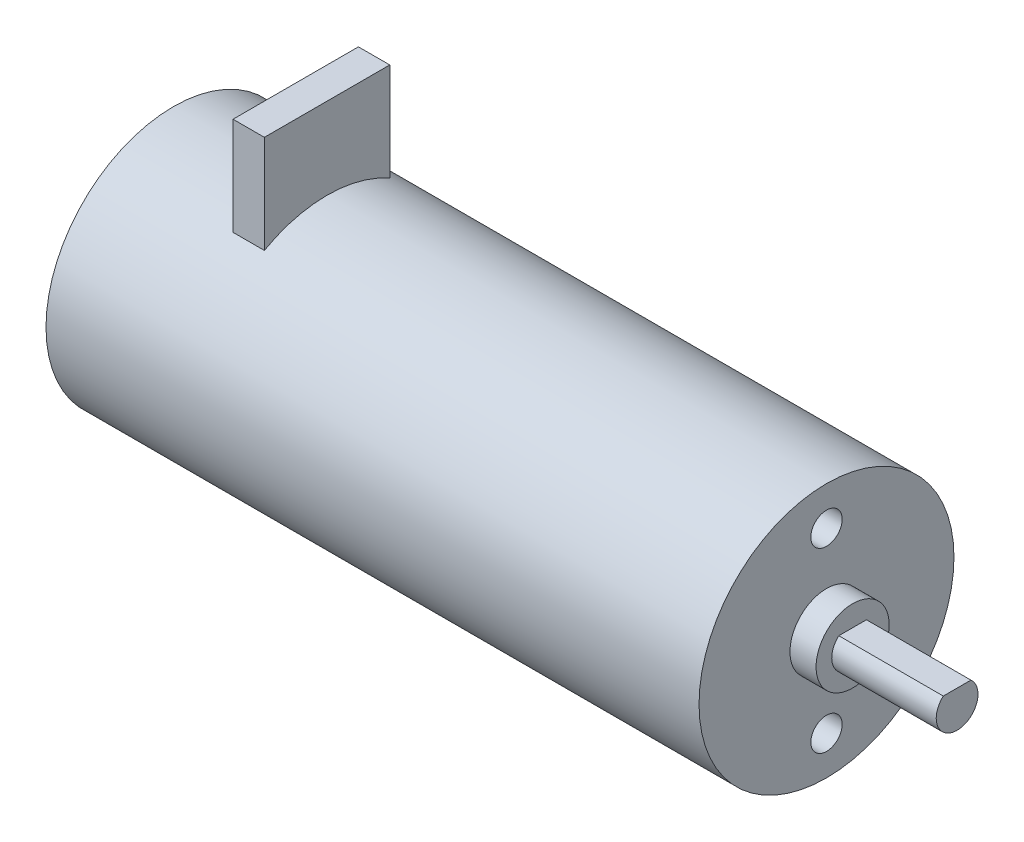
ISO-10303-21;
HEADER;
FILE_DESCRIPTION(('STEP AP214'),'2;1');
FILE_NAME('part.step','',(''),(''),'','','');
FILE_SCHEMA(('AUTOMOTIVE_DESIGN { 1 0 10303 214 1 1 1 1 }'));
ENDSEC;
DATA;
#1=APPLICATION_CONTEXT('core data for automotive mechanical design processes');
#2=APPLICATION_PROTOCOL_DEFINITION('international standard','automotive_design',2000,#1);
#3=PRODUCT_CONTEXT('',#1,'mechanical');
#4=PRODUCT('Part','Part','',(#3));
#5=PRODUCT_RELATED_PRODUCT_CATEGORY('part','',(#4));
#6=PRODUCT_DEFINITION_FORMATION('','',#4);
#7=PRODUCT_DEFINITION_CONTEXT('part definition',#1,'design');
#8=PRODUCT_DEFINITION('design','',#6,#7);
#9=PRODUCT_DEFINITION_SHAPE('','',#8);
#10=(LENGTH_UNIT() NAMED_UNIT(*) SI_UNIT(.MILLI.,.METRE.));
#11=(NAMED_UNIT(*) PLANE_ANGLE_UNIT() SI_UNIT($,.RADIAN.));
#12=(NAMED_UNIT(*) SI_UNIT($,.STERADIAN.) SOLID_ANGLE_UNIT());
#13=UNCERTAINTY_MEASURE_WITH_UNIT(LENGTH_MEASURE(1.E-05),#10,'distance_accuracy_value','');
#14=(GEOMETRIC_REPRESENTATION_CONTEXT(3) GLOBAL_UNCERTAINTY_ASSIGNED_CONTEXT((#13)) GLOBAL_UNIT_ASSIGNED_CONTEXT((#10,
#11,#12)) REPRESENTATION_CONTEXT('',''));
#15=CARTESIAN_POINT('',(0.,0.,0.));
#16=DIRECTION('',(0.,0.,1.));
#17=DIRECTION('',(1.,0.,0.));
#18=AXIS2_PLACEMENT_3D('',#15,#16,#17);
#19=CARTESIAN_POINT('',(62.5,0.,0.));
#20=DIRECTION('',(-1.,0.,0.));
#21=DIRECTION('',(0.,0.,1.));
#22=AXIS2_PLACEMENT_3D('',#19,#20,#21);
#23=CYLINDRICAL_SURFACE('',#22,12.2);
#24=CARTESIAN_POINT('',(0.,0.,0.));
#25=DIRECTION('',(1.,0.,0.));
#26=DIRECTION('',(0.,0.,-1.));
#27=AXIS2_PLACEMENT_3D('',#24,#25,#26);
#28=CIRCLE('',#27,12.2);
#29=CARTESIAN_POINT('',(0.,0.,-12.2));
#30=VERTEX_POINT('',#29);
#31=EDGE_CURVE('E161',#30,#30,#28,.T.);
#32=ORIENTED_EDGE('',*,*,#31,.T.);
#33=EDGE_LOOP('',(#32));
#34=FACE_BOUND('',#33,.T.);
#35=CARTESIAN_POINT('',(62.5,0.,0.));
#36=DIRECTION('',(1.,0.,0.));
#37=DIRECTION('',(0.,0.,-1.));
#38=AXIS2_PLACEMENT_3D('',#35,#36,#37);
#39=CIRCLE('',#38,12.2);
#40=CARTESIAN_POINT('',(62.5,0.,-12.2));
#41=VERTEX_POINT('',#40);
#42=EDGE_CURVE('E167',#41,#41,#39,.T.);
#43=ORIENTED_EDGE('',*,*,#42,.F.);
#44=EDGE_LOOP('',(#43));
#45=FACE_BOUND('',#44,.T.);
#46=CARTESIAN_POINT('',(11.7,0.,0.));
#47=DIRECTION('',(1.,0.,0.));
#48=DIRECTION('',(0.,0.,-1.));
#49=AXIS2_PLACEMENT_3D('',#46,#47,#48);
#50=CIRCLE('',#49,12.2);
#51=CARTESIAN_POINT('',(11.7,10.6226173799116,-6.));
#52=VERTEX_POINT('',#51);
#53=CARTESIAN_POINT('',(11.7,10.6226173799116,6.));
#54=VERTEX_POINT('',#53);
#55=EDGE_CURVE('E11',#52,#54,#50,.T.);
#56=ORIENTED_EDGE('',*,*,#55,.F.);
#57=DIRECTION('',(-1.,0.,0.));
#58=VECTOR('',#57,1.);
#59=CARTESIAN_POINT('',(62.5,10.6226173799116,-6.));
#60=LINE('',#59,#58);
#61=CARTESIAN_POINT('',(14.7,10.6226173799116,-6.));
#62=VERTEX_POINT('',#61);
#63=EDGE_CURVE('E166',#62,#52,#60,.T.);
#64=ORIENTED_EDGE('',*,*,#63,.F.);
#65=CARTESIAN_POINT('',(14.7,0.,0.));
#66=DIRECTION('',(-1.,0.,0.));
#67=DIRECTION('',(0.,0.,1.));
#68=AXIS2_PLACEMENT_3D('',#65,#66,#67);
#69=CIRCLE('',#68,12.2);
#70=CARTESIAN_POINT('',(14.7,10.6226173799116,6.));
#71=VERTEX_POINT('',#70);
#72=EDGE_CURVE('E57',#71,#62,#69,.T.);
#73=ORIENTED_EDGE('',*,*,#72,.F.);
#74=DIRECTION('',(-1.,0.,0.));
#75=VECTOR('',#74,1.);
#76=CARTESIAN_POINT('',(62.5,10.6226173799116,6.));
#77=LINE('',#76,#75);
#78=EDGE_CURVE('E47',#54,#71,#77,.F.);
#79=ORIENTED_EDGE('',*,*,#78,.F.);
#80=EDGE_LOOP('',(#56,#64,#73,#79));
#81=FACE_BOUND('',#80,.T.);
#82=ADVANCED_FACE('F39',(#34,#45,#81),#23,.T.);
#83=CARTESIAN_POINT('',(62.5,0.,0.));
#84=DIRECTION('',(1.,0.,0.));
#85=DIRECTION('',(0.,0.,-1.));
#86=AXIS2_PLACEMENT_3D('',#83,#84,#85);
#87=PLANE('',#86);
#88=CARTESIAN_POINT('',(62.5,8.5,0.));
#89=DIRECTION('',(1.,0.,0.));
#90=DIRECTION('',(0.,0.,-1.));
#91=AXIS2_PLACEMENT_3D('',#88,#89,#90);
#92=CIRCLE('',#91,1.5);
#93=CARTESIAN_POINT('',(62.5,8.5,-1.5));
#94=VERTEX_POINT('',#93);
#95=EDGE_CURVE('E128',#94,#94,#92,.T.);
#96=ORIENTED_EDGE('',*,*,#95,.F.);
#97=EDGE_LOOP('',(#96));
#98=FACE_BOUND('',#97,.T.);
#99=CARTESIAN_POINT('',(62.5,-8.5,0.));
#100=DIRECTION('',(1.,0.,0.));
#101=DIRECTION('',(0.,0.,1.));
#102=AXIS2_PLACEMENT_3D('',#99,#100,#101);
#103=CIRCLE('',#102,1.5);
#104=CARTESIAN_POINT('',(62.5,-8.5,1.5));
#105=VERTEX_POINT('',#104);
#106=EDGE_CURVE('E112',#105,#105,#103,.T.);
#107=ORIENTED_EDGE('',*,*,#106,.F.);
#108=EDGE_LOOP('',(#107));
#109=FACE_BOUND('',#108,.T.);
#110=CARTESIAN_POINT('',(62.5,0.,0.));
#111=DIRECTION('',(1.,0.,0.));
#112=DIRECTION('',(0.,0.,-1.));
#113=AXIS2_PLACEMENT_3D('',#110,#111,#112);
#114=CIRCLE('',#113,3.5);
#115=CARTESIAN_POINT('',(62.5,0.,-3.5));
#116=VERTEX_POINT('',#115);
#117=EDGE_CURVE('E162',#116,#116,#114,.T.);
#118=ORIENTED_EDGE('',*,*,#117,.F.);
#119=EDGE_LOOP('',(#118));
#120=FACE_BOUND('',#119,.T.);
#121=ORIENTED_EDGE('',*,*,#42,.T.);
#122=EDGE_LOOP('',(#121));
#123=FACE_BOUND('',#122,.T.);
#124=ADVANCED_FACE('F194',(#98,#109,#120,#123),#87,.T.);
#125=CARTESIAN_POINT('',(0.,0.,0.));
#126=DIRECTION('',(1.,0.,0.));
#127=DIRECTION('',(0.,0.,-1.));
#128=AXIS2_PLACEMENT_3D('',#125,#126,#127);
#129=PLANE('',#128);
#130=ORIENTED_EDGE('',*,*,#31,.F.);
#131=EDGE_LOOP('',(#130));
#132=FACE_BOUND('',#131,.T.);
#133=ADVANCED_FACE('F199',(#132),#129,.F.);
#134=CARTESIAN_POINT('',(65.,0.,0.));
#135=DIRECTION('',(-1.,0.,0.));
#136=DIRECTION('',(0.,0.,1.));
#137=AXIS2_PLACEMENT_3D('',#134,#135,#136);
#138=CYLINDRICAL_SURFACE('',#137,3.5);
#139=CARTESIAN_POINT('',(65.,0.,0.));
#140=DIRECTION('',(1.,0.,0.));
#141=DIRECTION('',(0.,0.,-1.));
#142=AXIS2_PLACEMENT_3D('',#139,#140,#141);
#143=CIRCLE('',#142,3.5);
#144=CARTESIAN_POINT('',(65.,0.,-3.5));
#145=VERTEX_POINT('',#144);
#146=EDGE_CURVE('E157',#145,#145,#143,.T.);
#147=ORIENTED_EDGE('',*,*,#146,.F.);
#148=EDGE_LOOP('',(#147));
#149=FACE_BOUND('',#148,.T.);
#150=ORIENTED_EDGE('',*,*,#117,.T.);
#151=EDGE_LOOP('',(#150));
#152=FACE_BOUND('',#151,.T.);
#153=ADVANCED_FACE('F208',(#149,#152),#138,.T.);
#154=CARTESIAN_POINT('',(65.,0.,0.));
#155=DIRECTION('',(1.,0.,0.));
#156=DIRECTION('',(0.,0.,-1.));
#157=AXIS2_PLACEMENT_3D('',#154,#155,#156);
#158=PLANE('',#157);
#159=CARTESIAN_POINT('',(65.,0.,0.));
#160=DIRECTION('',(1.,0.,0.));
#161=DIRECTION('',(0.,0.,-1.));
#162=AXIS2_PLACEMENT_3D('',#159,#160,#161);
#163=CIRCLE('',#162,2.);
#164=CARTESIAN_POINT('',(65.,1.5,1.3228756555323));
#165=VERTEX_POINT('',#164);
#166=CARTESIAN_POINT('',(65.,1.5,-1.3228756555323));
#167=VERTEX_POINT('',#166);
#168=EDGE_CURVE('E127',#165,#167,#163,.T.);
#169=ORIENTED_EDGE('',*,*,#168,.F.);
#170=DIRECTION('',(0.,0.,1.));
#171=VECTOR('',#170,1.);
#172=CARTESIAN_POINT('',(65.,1.5,1.3228756555323));
#173=LINE('',#172,#171);
#174=EDGE_CURVE('E140',#167,#165,#173,.T.);
#175=ORIENTED_EDGE('',*,*,#174,.F.);
#176=EDGE_LOOP('',(#169,#175));
#177=FACE_BOUND('',#176,.T.);
#178=ORIENTED_EDGE('',*,*,#146,.T.);
#179=EDGE_LOOP('',(#178));
#180=FACE_BOUND('',#179,.T.);
#181=ADVANCED_FACE('F212',(#177,#180),#158,.T.);
#182=CARTESIAN_POINT('',(75.,0.,0.));
#183=DIRECTION('',(-1.,0.,0.));
#184=DIRECTION('',(0.,0.,1.));
#185=AXIS2_PLACEMENT_3D('',#182,#183,#184);
#186=CYLINDRICAL_SURFACE('',#185,2.);
#187=ORIENTED_EDGE('',*,*,#168,.T.);
#188=DIRECTION('',(-1.,0.,0.));
#189=VECTOR('',#188,1.);
#190=CARTESIAN_POINT('',(75.,1.5,-1.3228756555323));
#191=LINE('',#190,#189);
#192=CARTESIAN_POINT('',(75.,1.5,-1.3228756555323));
#193=VERTEX_POINT('',#192);
#194=EDGE_CURVE('E153',#193,#167,#191,.T.);
#195=ORIENTED_EDGE('',*,*,#194,.F.);
#196=CARTESIAN_POINT('',(75.,0.,0.));
#197=DIRECTION('',(1.,0.,0.));
#198=DIRECTION('',(0.,0.,-1.));
#199=AXIS2_PLACEMENT_3D('',#196,#197,#198);
#200=CIRCLE('',#199,2.);
#201=CARTESIAN_POINT('',(75.,1.5,1.3228756555323));
#202=VERTEX_POINT('',#201);
#203=EDGE_CURVE('E135',#202,#193,#200,.T.);
#204=ORIENTED_EDGE('',*,*,#203,.F.);
#205=DIRECTION('',(-1.,0.,0.));
#206=VECTOR('',#205,1.);
#207=CARTESIAN_POINT('',(75.,1.5,1.3228756555323));
#208=LINE('',#207,#206);
#209=EDGE_CURVE('E143',#202,#165,#208,.T.);
#210=ORIENTED_EDGE('',*,*,#209,.T.);
#211=EDGE_LOOP('',(#187,#195,#204,#210));
#212=FACE_BOUND('',#211,.T.);
#213=ADVANCED_FACE('F218',(#212),#186,.T.);
#214=CARTESIAN_POINT('',(75.,1.5,1.3228756555323));
#215=DIRECTION('',(0.,-1.,0.));
#216=DIRECTION('',(0.,0.,-1.));
#217=AXIS2_PLACEMENT_3D('',#214,#215,#216);
#218=PLANE('',#217);
#219=ORIENTED_EDGE('',*,*,#174,.T.);
#220=ORIENTED_EDGE('',*,*,#209,.F.);
#221=DIRECTION('',(0.,0.,1.));
#222=VECTOR('',#221,1.);
#223=CARTESIAN_POINT('',(75.,1.5,1.3228756555323));
#224=LINE('',#223,#222);
#225=EDGE_CURVE('E139',#193,#202,#224,.T.);
#226=ORIENTED_EDGE('',*,*,#225,.F.);
#227=ORIENTED_EDGE('',*,*,#194,.T.);
#228=EDGE_LOOP('',(#219,#220,#226,#227));
#229=FACE_BOUND('',#228,.T.);
#230=ADVANCED_FACE('F222',(#229),#218,.F.);
#231=CARTESIAN_POINT('',(75.,0.,0.));
#232=DIRECTION('',(1.,0.,0.));
#233=DIRECTION('',(0.,0.,-1.));
#234=AXIS2_PLACEMENT_3D('',#231,#232,#233);
#235=PLANE('',#234);
#236=ORIENTED_EDGE('',*,*,#203,.T.);
#237=ORIENTED_EDGE('',*,*,#225,.T.);
#238=EDGE_LOOP('',(#236,#237));
#239=FACE_BOUND('',#238,.T.);
#240=ADVANCED_FACE('F226',(#239),#235,.T.);
#241=CARTESIAN_POINT('',(57.5,-8.5,0.));
#242=DIRECTION('',(1.,0.,0.));
#243=DIRECTION('',(0.,0.,-1.));
#244=AXIS2_PLACEMENT_3D('',#241,#242,#243);
#245=CYLINDRICAL_SURFACE('',#244,1.5);
#246=CARTESIAN_POINT('',(57.5,-8.5,0.));
#247=DIRECTION('',(1.,0.,0.));
#248=DIRECTION('',(0.,0.,1.));
#249=AXIS2_PLACEMENT_3D('',#246,#247,#248);
#250=CIRCLE('',#249,1.5);
#251=CARTESIAN_POINT('',(57.5,-8.5,1.5));
#252=VERTEX_POINT('',#251);
#253=EDGE_CURVE('E117',#252,#252,#250,.T.);
#254=ORIENTED_EDGE('',*,*,#253,.F.);
#255=EDGE_LOOP('',(#254));
#256=FACE_BOUND('',#255,.T.);
#257=ORIENTED_EDGE('',*,*,#106,.T.);
#258=EDGE_LOOP('',(#257));
#259=FACE_BOUND('',#258,.T.);
#260=ADVANCED_FACE('F230',(#256,#259),#245,.F.);
#261=CARTESIAN_POINT('',(57.5,-8.5,0.));
#262=DIRECTION('',(-1.,0.,0.));
#263=DIRECTION('',(0.,0.,1.));
#264=AXIS2_PLACEMENT_3D('',#261,#262,#263);
#265=PLANE('',#264);
#266=ORIENTED_EDGE('',*,*,#253,.T.);
#267=EDGE_LOOP('',(#266));
#268=FACE_BOUND('',#267,.T.);
#269=ADVANCED_FACE('F234',(#268),#265,.F.);
#270=CARTESIAN_POINT('',(57.5,8.5,0.));
#271=DIRECTION('',(1.,0.,0.));
#272=DIRECTION('',(0.,0.,-1.));
#273=AXIS2_PLACEMENT_3D('',#270,#271,#272);
#274=CYLINDRICAL_SURFACE('',#273,1.5);
#275=CARTESIAN_POINT('',(57.5,8.5,0.));
#276=DIRECTION('',(1.,0.,0.));
#277=DIRECTION('',(0.,0.,-1.));
#278=AXIS2_PLACEMENT_3D('',#275,#276,#277);
#279=CIRCLE('',#278,1.5);
#280=CARTESIAN_POINT('',(57.5,8.5,-1.5));
#281=VERTEX_POINT('',#280);
#282=EDGE_CURVE('E123',#281,#281,#279,.T.);
#283=ORIENTED_EDGE('',*,*,#282,.F.);
#284=EDGE_LOOP('',(#283));
#285=FACE_BOUND('',#284,.T.);
#286=ORIENTED_EDGE('',*,*,#95,.T.);
#287=EDGE_LOOP('',(#286));
#288=FACE_BOUND('',#287,.T.);
#289=ADVANCED_FACE('F238',(#285,#288),#274,.F.);
#290=CARTESIAN_POINT('',(57.5,8.5,0.));
#291=DIRECTION('',(1.,0.,0.));
#292=DIRECTION('',(0.,0.,-1.));
#293=AXIS2_PLACEMENT_3D('',#290,#291,#292);
#294=PLANE('',#293);
#295=ORIENTED_EDGE('',*,*,#282,.T.);
#296=EDGE_LOOP('',(#295));
#297=FACE_BOUND('',#296,.T.);
#298=ADVANCED_FACE('F242',(#297),#294,.T.);
#299=CARTESIAN_POINT('',(11.7,20.,6.));
#300=DIRECTION('',(0.,0.,-1.));
#301=DIRECTION('',(-1.,0.,0.));
#302=AXIS2_PLACEMENT_3D('',#299,#300,#301);
#303=PLANE('',#302);
#304=DIRECTION('',(0.,-1.,0.));
#305=VECTOR('',#304,1.);
#306=CARTESIAN_POINT('',(11.7,20.,6.));
#307=LINE('',#306,#305);
#308=CARTESIAN_POINT('',(11.7,20.,6.));
#309=VERTEX_POINT('',#308);
#310=EDGE_CURVE('E92',#309,#54,#307,.T.);
#311=ORIENTED_EDGE('',*,*,#310,.T.);
#312=ORIENTED_EDGE('',*,*,#78,.T.);
#313=DIRECTION('',(0.,-1.,0.));
#314=VECTOR('',#313,1.);
#315=CARTESIAN_POINT('',(14.7,20.,6.));
#316=LINE('',#315,#314);
#317=CARTESIAN_POINT('',(14.7,20.,6.));
#318=VERTEX_POINT('',#317);
#319=EDGE_CURVE('E94',#318,#71,#316,.T.);
#320=ORIENTED_EDGE('',*,*,#319,.F.);
#321=DIRECTION('',(1.,0.,0.));
#322=VECTOR('',#321,1.);
#323=CARTESIAN_POINT('',(11.7,20.,6.));
#324=LINE('',#323,#322);
#325=EDGE_CURVE('E88',#309,#318,#324,.T.);
#326=ORIENTED_EDGE('',*,*,#325,.F.);
#327=EDGE_LOOP('',(#311,#312,#320,#326));
#328=FACE_BOUND('',#327,.T.);
#329=ADVANCED_FACE('F90',(#328),#303,.F.);
#330=CARTESIAN_POINT('',(11.7,20.,-6.));
#331=DIRECTION('',(0.,0.,1.));
#332=DIRECTION('',(1.,0.,0.));
#333=AXIS2_PLACEMENT_3D('',#330,#331,#332);
#334=PLANE('',#333);
#335=DIRECTION('',(0.,-1.,0.));
#336=VECTOR('',#335,1.);
#337=CARTESIAN_POINT('',(14.7,20.,-6.));
#338=LINE('',#337,#336);
#339=CARTESIAN_POINT('',(14.7,20.,-6.));
#340=VERTEX_POINT('',#339);
#341=EDGE_CURVE('E119',#340,#62,#338,.T.);
#342=ORIENTED_EDGE('',*,*,#341,.T.);
#343=ORIENTED_EDGE('',*,*,#63,.T.);
#344=DIRECTION('',(0.,-1.,0.));
#345=VECTOR('',#344,1.);
#346=CARTESIAN_POINT('',(11.7,20.,-6.));
#347=LINE('',#346,#345);
#348=CARTESIAN_POINT('',(11.7,20.,-6.));
#349=VERTEX_POINT('',#348);
#350=EDGE_CURVE('E186',#349,#52,#347,.T.);
#351=ORIENTED_EDGE('',*,*,#350,.F.);
#352=DIRECTION('',(-1.,0.,0.));
#353=VECTOR('',#352,1.);
#354=CARTESIAN_POINT('',(11.7,20.,-6.));
#355=LINE('',#354,#353);
#356=EDGE_CURVE('E104',#340,#349,#355,.T.);
#357=ORIENTED_EDGE('',*,*,#356,.F.);
#358=EDGE_LOOP('',(#342,#343,#351,#357));
#359=FACE_BOUND('',#358,.T.);
#360=ADVANCED_FACE('F192',(#359),#334,.F.);
#361=CARTESIAN_POINT('',(11.7,20.,-6.));
#362=DIRECTION('',(1.,0.,0.));
#363=DIRECTION('',(0.,0.,-1.));
#364=AXIS2_PLACEMENT_3D('',#361,#362,#363);
#365=PLANE('',#364);
#366=ORIENTED_EDGE('',*,*,#350,.T.);
#367=ORIENTED_EDGE('',*,*,#55,.T.);
#368=ORIENTED_EDGE('',*,*,#310,.F.);
#369=DIRECTION('',(0.,0.,1.));
#370=VECTOR('',#369,1.);
#371=CARTESIAN_POINT('',(11.7,20.,-6.));
#372=LINE('',#371,#370);
#373=EDGE_CURVE('E99',#349,#309,#372,.T.);
#374=ORIENTED_EDGE('',*,*,#373,.F.);
#375=EDGE_LOOP('',(#366,#367,#368,#374));
#376=FACE_BOUND('',#375,.T.);
#377=ADVANCED_FACE('F110',(#376),#365,.F.);
#378=CARTESIAN_POINT('',(14.7,20.,-6.));
#379=DIRECTION('',(-1.,0.,0.));
#380=DIRECTION('',(0.,0.,1.));
#381=AXIS2_PLACEMENT_3D('',#378,#379,#380);
#382=PLANE('',#381);
#383=ORIENTED_EDGE('',*,*,#319,.T.);
#384=ORIENTED_EDGE('',*,*,#72,.T.);
#385=ORIENTED_EDGE('',*,*,#341,.F.);
#386=DIRECTION('',(0.,0.,-1.));
#387=VECTOR('',#386,1.);
#388=CARTESIAN_POINT('',(14.7,20.,-6.));
#389=LINE('',#388,#387);
#390=EDGE_CURVE('E98',#318,#340,#389,.T.);
#391=ORIENTED_EDGE('',*,*,#390,.F.);
#392=EDGE_LOOP('',(#383,#384,#385,#391));
#393=FACE_BOUND('',#392,.T.);
#394=ADVANCED_FACE('F180',(#393),#382,.F.);
#395=CARTESIAN_POINT('',(0.,20.,0.));
#396=DIRECTION('',(0.,1.,0.));
#397=DIRECTION('',(0.,0.,1.));
#398=AXIS2_PLACEMENT_3D('',#395,#396,#397);
#399=PLANE('',#398);
#400=ORIENTED_EDGE('',*,*,#373,.T.);
#401=ORIENTED_EDGE('',*,*,#325,.T.);
#402=ORIENTED_EDGE('',*,*,#390,.T.);
#403=ORIENTED_EDGE('',*,*,#356,.T.);
#404=EDGE_LOOP('',(#400,#401,#402,#403));
#405=FACE_BOUND('',#404,.T.);
#406=ADVANCED_FACE('F102',(#405),#399,.T.);
#407=CLOSED_SHELL('',(#82,#124,#133,#153,#181,#213,#230,#240,#260,#269,#289,#298,#329,#360,#377,
#394,#406));
#408=MANIFOLD_SOLID_BREP('B2',#407);
#409=ADVANCED_BREP_SHAPE_REPRESENTATION('',(#18,#408),#14);
#410=SHAPE_DEFINITION_REPRESENTATION(#9,#409);
ENDSEC;
END-ISO-10303-21;
